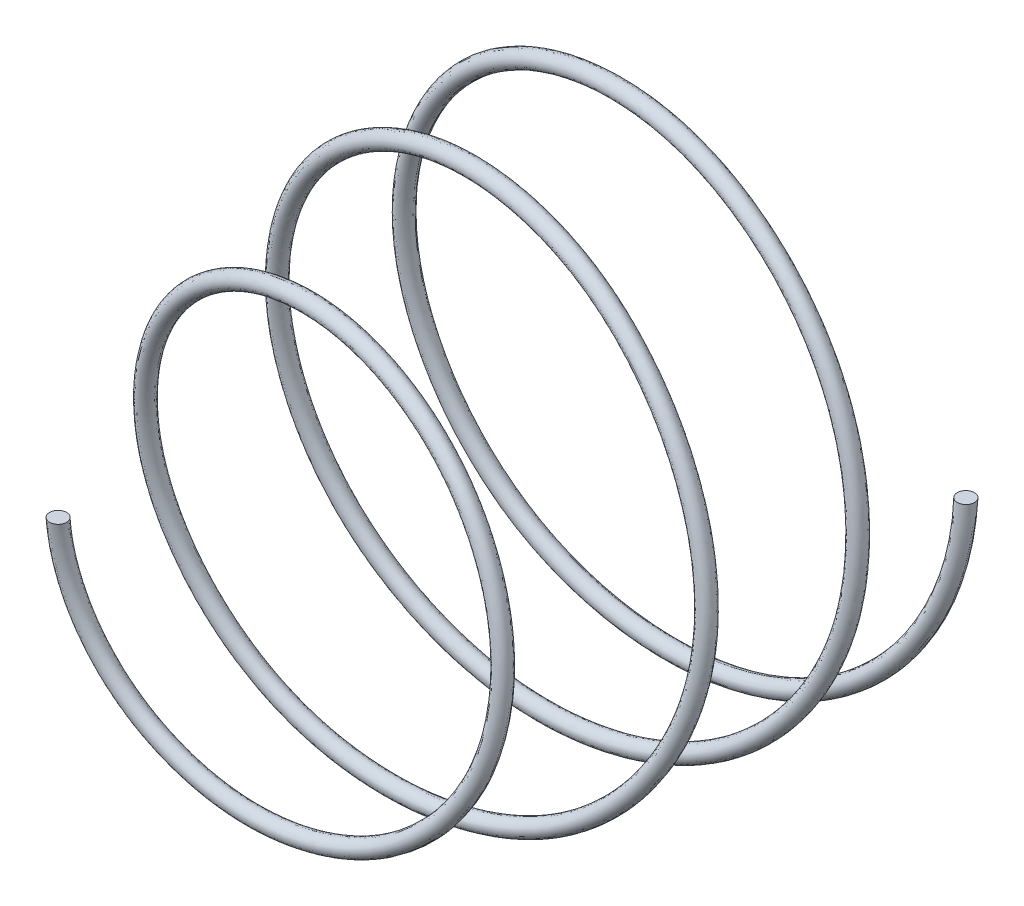
ISO-10303-21;
HEADER;
FILE_DESCRIPTION(('STEP AP214'),'2;1');
FILE_NAME('part.step','',(''),(''),'','','');
FILE_SCHEMA(('AUTOMOTIVE_DESIGN { 1 0 10303 214 1 1 1 1 }'));
ENDSEC;
DATA;
#1=APPLICATION_CONTEXT('core data for automotive mechanical design processes');
#2=APPLICATION_PROTOCOL_DEFINITION('international standard','automotive_design',2000,#1);
#3=PRODUCT_CONTEXT('',#1,'mechanical');
#4=PRODUCT('Part','Part','',(#3));
#5=PRODUCT_RELATED_PRODUCT_CATEGORY('part','',(#4));
#6=PRODUCT_DEFINITION_FORMATION('','',#4);
#7=PRODUCT_DEFINITION_CONTEXT('part definition',#1,'design');
#8=PRODUCT_DEFINITION('design','',#6,#7);
#9=PRODUCT_DEFINITION_SHAPE('','',#8);
#10=(LENGTH_UNIT() NAMED_UNIT(*) SI_UNIT(.MILLI.,.METRE.));
#11=(NAMED_UNIT(*) PLANE_ANGLE_UNIT() SI_UNIT($,.RADIAN.));
#12=(NAMED_UNIT(*) SI_UNIT($,.STERADIAN.) SOLID_ANGLE_UNIT());
#13=UNCERTAINTY_MEASURE_WITH_UNIT(LENGTH_MEASURE(1.E-05),#10,'distance_accuracy_value','');
#14=(GEOMETRIC_REPRESENTATION_CONTEXT(3) GLOBAL_UNCERTAINTY_ASSIGNED_CONTEXT((#13)) GLOBAL_UNIT_ASSIGNED_CONTEXT((#10,
#11,#12)) REPRESENTATION_CONTEXT('',''));
#15=CARTESIAN_POINT('',(0.,0.,0.));
#16=DIRECTION('',(0.,0.,1.));
#17=DIRECTION('',(1.,0.,0.));
#18=AXIS2_PLACEMENT_3D('',#15,#16,#17);
#19=CARTESIAN_POINT('',(3.,0.,0.));
#20=DIRECTION('',(0.,1.,0.));
#21=DIRECTION('',(0.,0.,1.));
#22=AXIS2_PLACEMENT_3D('',#19,#20,#21);
#23=PLANE('',#22);
#24=CARTESIAN_POINT('',(3.,0.,0.));
#25=DIRECTION('',(0.,1.,0.));
#26=DIRECTION('',(0.,0.,1.));
#27=AXIS2_PLACEMENT_3D('',#24,#25,#26);
#28=CIRCLE('',#27,0.0999999999999999);
#29=CARTESIAN_POINT('',(3.,0.,0.0999999999999999));
#30=VERTEX_POINT('',#29);
#31=EDGE_CURVE('E40',#30,#30,#28,.T.);
#32=ORIENTED_EDGE('',*,*,#31,.T.);
#33=EDGE_LOOP('',(#32));
#34=FACE_BOUND('',#33,.T.);
#35=ADVANCED_FACE('F36',(#34),#23,.T.);
#36=CARTESIAN_POINT('',(-2.1,1.02649551361988E-13,5.5));
#37=DIRECTION('',(0.,-1.,0.));
#38=DIRECTION('',(0.,0.,1.));
#39=AXIS2_PLACEMENT_3D('',#36,#37,#38);
#40=PLANE('',#39);
#41=CARTESIAN_POINT('',(-2.1,1.02649551361988E-13,5.5));
#42=DIRECTION('',(0.,-1.,0.));
#43=DIRECTION('',(0.,0.,1.));
#44=AXIS2_PLACEMENT_3D('',#41,#42,#43);
#45=CIRCLE('',#44,0.0999999999999999);
#46=CARTESIAN_POINT('',(-2.1,1.02649551361988E-13,5.6));
#47=VERTEX_POINT('',#46);
#48=EDGE_CURVE('E11',#47,#47,#45,.T.);
#49=ORIENTED_EDGE('',*,*,#48,.F.);
#50=EDGE_LOOP('',(#49));
#51=FACE_BOUND('',#50,.T.);
#52=ADVANCED_FACE('F77',(#51),#40,.F.);
#53=CARTESIAN_POINT('',(3.,0.,0.0999999999999999));
#54=CARTESIAN_POINT('',(2.99893943573948,-1.19945864909257,0.163633254270528));
#55=CARTESIAN_POINT('',(2.26141590246535,-2.24495827730856,0.225000000000012));
#56=CARTESIAN_POINT('',(0.309343025152512,-3.16948884114898,0.349999999999987));
#57=CARTESIAN_POINT('',(-0.858069160368535,-3.03935590705679,0.412499999999985));
#58=CARTESIAN_POINT('',(-2.51387042613628,-1.90838900097573,0.537500000000014));
#59=CARTESIAN_POINT('',(-2.99166666349542,-0.939532536844841,0.599999999999923));
#60=CARTESIAN_POINT('',(-2.98958333650458,0.93953253684488,0.725000000000075));
#61=CARTESIAN_POINT('',(-2.52383536970723,1.82979073821942,0.78750000000008));
#62=CARTESIAN_POINT('',(-1.11595664465713,2.90862029209121,0.912499999999918));
#63=CARTESIAN_POINT('',(-0.19218480510744,3.0959130192802,0.975000000000065));
#64=CARTESIAN_POINT('',(1.45328381503669,2.73809125305758,1.09999999999993));
#65=CARTESIAN_POINT('',(2.16476140340705,2.20292272191459,1.16249999999993));
#66=CARTESIAN_POINT('',(2.97646651153555,0.816875578736462,1.28750000000007));
#67=CARTESIAN_POINT('',(3.07674781408581,-0.0226899579926507,1.34999999999989));
#68=CARTESIAN_POINT('',(2.67930306497685,-1.50858152027044,1.47500000000011));
#69=CARTESIAN_POINT('',(2.18798393169004,-2.14837178627692,1.53750000000006));
#70=CARTESIAN_POINT('',(0.927966777340193,-2.92048914877486,1.66249999999993));
#71=CARTESIAN_POINT('',(0.166784962057753,-3.05241073871986,1.72500000000009));
#72=CARTESIAN_POINT('',(-1.23351426897467,-2.79483242778729,1.84999999999991));
#73=CARTESIAN_POINT('',(-1.86767735178331,-2.40918892074778,1.91249999999995));
#74=CARTESIAN_POINT('',(-2.73482571968324,-1.34192714345778,2.03750000000005));
#75=CARTESIAN_POINT('',(-2.96666666501538,-0.665484682180983,2.10000000000031));
#76=CARTESIAN_POINT('',(-2.96458333498463,0.665484682181117,2.22499999999969));
#77=CARTESIAN_POINT('',(-2.73263806383586,1.31594417076952,2.28750000000012));
#78=CARTESIAN_POINT('',(-1.93642374829777,2.33172450860302,2.41249999999988));
#79=CARTESIAN_POINT('',(-1.37563361890175,2.69529116691865,2.47499999999976));
#80=CARTESIAN_POINT('',(-0.164658784611858,3.01952299228008,2.60000000000024));
#81=CARTESIAN_POINT('',(0.482188493013176,2.98074741162969,2.66250000000024));
#82=CARTESIAN_POINT('',(2.19064349072477,2.32708601749865,2.84999999999952));
#83=CARTESIAN_POINT('',(2.9722916653456,1.15846277857306,2.9749999999998));
#84=CARTESIAN_POINT('',(2.931423612212,-0.965385648811021,3.20416666666683));
#85=CARTESIAN_POINT('',(2.36851985176624,-1.9001023240065,3.30833333333326));
#86=CARTESIAN_POINT('',(0.707269038493868,-2.88395233209354,3.51666666666674));
#87=CARTESIAN_POINT('',(-0.383655631251347,-2.9109885986085,3.62083333333363));
#88=CARTESIAN_POINT('',(-2.07667508609293,-1.98006422888091,3.82916666666637));
#89=CARTESIAN_POINT('',(-2.64212576016027,-1.03288439562604,3.93333333333374));
#90=CARTESIAN_POINT('',(-2.62462455435238,0.419628276364011,4.08958333333313));
#91=CARTESIAN_POINT('',(-2.48181132610865,0.902251102107171,4.14166666666663));
#92=CARTESIAN_POINT('',(-1.95828416959761,1.71928776876791,4.24583333333336));
#93=CARTESIAN_POINT('',(-1.57806748840913,2.05217328132252,4.29791666666654));
#94=CARTESIAN_POINT('',(-0.693770113991437,2.45795464461471,4.40208333333346));
#95=CARTESIAN_POINT('',(-0.191047487642285,2.52971768684621,4.4541666666663));
#96=CARTESIAN_POINT('',(0.773576208019876,2.37959228018941,4.5583333333337));
#97=CARTESIAN_POINT('',(1.23353528986769,2.15746751906624,4.61041666666629));
#98=CARTESIAN_POINT('',(1.94819923504846,1.48642760332087,4.71458333333371));
#99=CARTESIAN_POINT('',(2.20096048230321,1.03849260293051,4.7666666666664));
#100=CARTESIAN_POINT('',(2.39787352073171,0.0730164501274613,4.87083333333361));
#101=CARTESIAN_POINT('',(2.34085561055816,-0.442385695712135,4.92291666666672));
#102=CARTESIAN_POINT('',(1.92574091794239,-1.34276949725769,5.02708333333328));
#103=CARTESIAN_POINT('',(1.56797137832335,-1.7250201943906,5.07916666666652));
#104=CARTESIAN_POINT('',(0.68499714192297,-2.19202389641041,5.18333333333348));
#105=CARTESIAN_POINT('',(0.161940533937115,-2.27450193709028,5.235416666667));
#106=CARTESIAN_POINT('',(-0.828319883497029,-2.08738925968207,5.339583333333));
#107=CARTESIAN_POINT('',(-1.29197514442853,-1.81723610016765,5.3916666666662));
#108=CARTESIAN_POINT('',(-1.93847784203699,-1.03021233039892,5.4958333333338));
#109=CARTESIAN_POINT('',(-2.11776242487542,-0.516992193965065,5.54775756804655));
#110=CARTESIAN_POINT('',(-2.1,1.02649551361988E-13,5.6));
#111=CARTESIAN_POINT('',(3.05235987755983,0.,0.0999999999999999));
#112=CARTESIAN_POINT('',(3.05129931193206,-1.22039450177743,0.163633325912949));
#113=CARTESIAN_POINT('',(2.30091840642026,-2.28416460740022,0.225000000000012));
#114=CARTESIAN_POINT('',(0.314755515211678,-3.22488098052188,0.349999999999987));
#115=CARTESIAN_POINT('',(-0.873066297868183,-3.09249836484038,0.412499999999985));
#116=CARTESIAN_POINT('',(-2.55784759974763,-1.94178126305247,0.537500000000014));
#117=CARTESIAN_POINT('',(-3.04402654100071,-0.955981877231045,0.599999999999923));
#118=CARTESIAN_POINT('',(-3.04194321411896,0.955981877231085,0.725000000000075));
#119=CARTESIAN_POINT('',(-2.56805779175232,1.86184575593354,0.78750000000008));
#120=CARTESIAN_POINT('',(-1.13552637799794,2.95961217692946,0.912499999999918));
#121=CARTESIAN_POINT('',(-0.195560485642378,3.15021193157343,0.975000000000065));
#122=CARTESIAN_POINT('',(1.47878506281794,2.78614802642152,1.09999999999993));
#123=CARTESIAN_POINT('',(2.20276546647432,2.24160352379545,1.16249999999993));
#124=CARTESIAN_POINT('',(3.02875815132231,0.831231680596472,1.28750000000007));
#125=CARTESIAN_POINT('',(3.13082392926574,-0.0230841729868829,1.34999999999989));
#126=CARTESIAN_POINT('',(2.72642690589543,-1.53510934082298,1.47500000000011));
#127=CARTESIAN_POINT('',(2.22648275789266,-2.18616742299462,1.53750000000006));
#128=CARTESIAN_POINT('',(0.944308555375321,-2.9719052558982,1.66249999999993));
#129=CARTESIAN_POINT('',(0.169726750929349,-3.10617147784231,1.72500000000009));
#130=CARTESIAN_POINT('',(-1.25525019148232,-2.84409114145504,1.84999999999991));
#131=CARTESIAN_POINT('',(-1.9006033573851,-2.45166820643049,1.91249999999995));
#132=CARTESIAN_POINT('',(-2.78307411316886,-1.36560633451932,2.03750000000005));
#133=CARTESIAN_POINT('',(-3.01902654254697,-0.677234211024585,2.10000000000031));
#134=CARTESIAN_POINT('',(-3.01694321257269,0.677234211024722,2.22499999999969));
#135=CARTESIAN_POINT('',(-2.78092080281225,1.33919112357637,2.28750000000012));
#136=CARTESIAN_POINT('',(-1.97066303625897,2.37294725551964,2.41249999999988));
#137=CARTESIAN_POINT('',(-1.39996774823375,2.74296084488417,2.47499999999976));
#138=CARTESIAN_POINT('',(-0.167576869566425,3.0729648563303,2.60000000000024));
#139=CARTESIAN_POINT('',(0.490722252855258,3.03352393456592,2.66250000000024));
#140=CARTESIAN_POINT('',(2.22945638909099,2.36833688806319,2.84999999999952));
#141=CARTESIAN_POINT('',(3.02465154290308,1.1790245800108,2.9749999999998));
#142=CARTESIAN_POINT('',(2.98378348977379,-0.982520483342477,3.20416666666683));
#143=CARTESIAN_POINT('',(2.41177701112666,-1.93453899446505,3.30833333333326));
#144=CARTESIAN_POINT('',(0.720644118146694,-2.93760094199822,3.51666666666674));
#145=CARTESIAN_POINT('',(-0.390689360751117,-2.96606161430292,3.62083333333363));
#146=CARTESIAN_POINT('',(-2.11669984613355,-2.01854187151929,3.82916666666637));
#147=CARTESIAN_POINT('',(-2.69399750441175,-1.0534207236583,3.93333333333374));
#148=CARTESIAN_POINT('',(-2.6772048669131,0.427969916836899,4.08958333333313));
#149=CARTESIAN_POINT('',(-2.53190544925863,0.920392327773807,4.14166666666663));
#150=CARTESIAN_POINT('',(-1.998365215033,1.75438812537419,4.24583333333336));
#151=CARTESIAN_POINT('',(-1.61062602280596,2.09440039377581,4.29791666666654));
#152=CARTESIAN_POINT('',(-0.708321733534218,2.50925218403518,4.40208333333346));
#153=CARTESIAN_POINT('',(-0.195138502360652,2.58293031350303,4.4541666666663));
#154=CARTESIAN_POINT('',(0.79000649251283,2.43036989121744,4.5583333333337));
#155=CARTESIAN_POINT('',(1.25998610622379,2.20388253008547,4.61041666666629));
#156=CARTESIAN_POINT('',(1.99062499963396,1.51889379228058,4.71458333333371));
#157=CARTESIAN_POINT('',(2.24929475569156,1.06138613749353,4.7666666666664));
#158=CARTESIAN_POINT('',(2.45132815527124,0.0747246499579956,4.87083333333361));
#159=CARTESIAN_POINT('',(2.39348763595019,-0.452247480929685,4.92291666666672));
#160=CARTESIAN_POINT('',(1.96971363712527,-1.3733273908852,5.02708333333328));
#161=CARTESIAN_POINT('',(1.60410371620409,-1.76464093225814,5.07916666666652));
#162=CARTESIAN_POINT('',(0.70107621466077,-2.2431786823009,5.18333333333348));
#163=CARTESIAN_POINT('',(0.165847259807495,-2.32806616207426,5.235416666667));
#164=CARTESIAN_POINT('',(-0.848041472212217,-2.13734371526117,5.339583333333));
#165=CARTESIAN_POINT('',(-1.3230704551939,-1.86114305284091,5.3916666666662));
#166=CARTESIAN_POINT('',(-1.98594096277659,-1.05554987174361,5.4958333333338));
#167=CARTESIAN_POINT('',(-2.1701225385308,-0.529889374115339,5.54775687323474));
#168=CARTESIAN_POINT('',(-2.15235987755983,1.05208940857648E-13,5.6));
#169=CARTESIAN_POINT('',(3.1,0.,0.0523598775598298));
#170=CARTESIAN_POINT('',(3.09893943322176,-1.23944313595987,0.115993263069124));
#171=CARTESIAN_POINT('',(2.33686012769245,-2.31983685212341,0.177359877559857));
#172=CARTESIAN_POINT('',(0.319680119720795,-3.27528003462468,0.302359877559802));
#173=CARTESIAN_POINT('',(-0.886711583152111,-3.14085052518861,0.364859877559815));
#174=CARTESIAN_POINT('',(-2.59786064089775,-1.97216352382203,0.489859877559844));
#175=CARTESIAN_POINT('',(-3.09166666339108,-0.970948462841628,0.552359877559753));
#176=CARTESIAN_POINT('',(-3.08958333660892,0.970948462841668,0.677359877559905));
#177=CARTESIAN_POINT('',(-2.60829397447499,1.89101131246029,0.73985987755991));
#178=CARTESIAN_POINT('',(-1.15333208221119,3.00600761844652,0.864859877559748));
#179=CARTESIAN_POINT('',(-0.198631880028693,3.1996163028321,0.927359877559895));
#180=CARTESIAN_POINT('',(1.5019876107095,2.82987292941648,1.05235987755976));
#181=CARTESIAN_POINT('',(2.23734381734371,2.27679761177967,1.11485987755976));
#182=CARTESIAN_POINT('',(3.076336186989,0.844293713631169,1.2398598775599));
#183=CARTESIAN_POINT('',(3.18002558649495,-0.0234428531723363,1.30235987755972));
#184=CARTESIAN_POINT('',(2.76930297161284,-1.55924592551512,1.42735987755994));
#185=CARTESIAN_POINT('',(2.26151127361062,-2.22055613520816,1.48985987755989));
#186=CARTESIAN_POINT('',(0.959177274378613,-3.01868668001343,1.61485987755976));
#187=CARTESIAN_POINT('',(0.172403364943154,-3.15508618722718,1.67735987755992));
#188=CARTESIAN_POINT('',(-1.27502682309177,-2.88890964103415,1.80235987755974));
#189=CARTESIAN_POINT('',(-1.93056139035675,-2.4903183802928,1.8648598775597));
#190=CARTESIAN_POINT('',(-2.8269733635171,-1.38715106712811,1.98985987755996));
#191=CARTESIAN_POINT('',(-3.06666666496152,-0.687924629314504,2.05235987756014));
#192=CARTESIAN_POINT('',(-3.06458333503848,0.687924629314643,2.17735987755952));
#193=CARTESIAN_POINT('',(-2.82485130272521,1.36034258018189,2.23985987755995));
#194=CARTESIAN_POINT('',(-2.00181597142137,2.41045415587833,2.36485987755971));
#195=CARTESIAN_POINT('',(-1.42210838253005,2.78633354552441,2.42735987755959));
#196=CARTESIAN_POINT('',(-0.170231916350441,3.12158943425971,2.55235987756007));
#197=CARTESIAN_POINT('',(0.498486773757496,3.08154314568385,2.61485987756007));
#198=CARTESIAN_POINT('',(2.26477066629325,2.40586937698469,2.80235987755935));
#199=CARTESIAN_POINT('',(3.07229166534116,1.19773292662535,2.92735987755963));
#200=CARTESIAN_POINT('',(3.0314236122157,-0.998110772187935,3.15652654422666));
#201=CARTESIAN_POINT('',(2.45113494060202,-1.96587151993188,3.26069321089309));
#202=CARTESIAN_POINT('',(0.732813558985918,-2.98641362956949,3.46902654422657));
#203=CARTESIAN_POINT('',(-0.397089065070535,-3.0161703107537,3.57319321089346));
#204=CARTESIAN_POINT('',(-2.15311674697125,-2.05355111317369,3.7815265442262));
#205=CARTESIAN_POINT('',(-2.74119349421325,-1.07210589305755,3.88569321089357));
#206=CARTESIAN_POINT('',(-2.72504555419269,0.435559636141085,4.04194321089296));
#207=CARTESIAN_POINT('',(-2.57748405393882,0.936898290970262,4.09402654422646));
#208=CARTESIAN_POINT('',(-2.0348333276615,1.78632451186603,4.19819321089319));
#209=CARTESIAN_POINT('',(-1.64024970867809,2.13282112547582,4.25027654422637));
#210=CARTESIAN_POINT('',(-0.721561660154186,2.5559257282213,4.35444321089329));
#211=CARTESIAN_POINT('',(-0.198860750218561,2.63134631765412,4.40652654422613));
#212=CARTESIAN_POINT('',(0.80495573994139,2.47657037371164,4.51069321089353));
#213=CARTESIAN_POINT('',(1.28405262793037,2.24611366031471,4.56277654422612));
#214=CARTESIAN_POINT('',(2.02922647682728,1.54843345679643,4.66694321089354));
#215=CARTESIAN_POINT('',(2.29327214466933,1.08221603321712,4.71902654422623));
#216=CARTESIAN_POINT('',(2.49996435254936,0.0762788714892765,4.82319321089344));
#217=CARTESIAN_POINT('',(2.44137537463095,-0.461220318093207,4.87527654422655));
#218=CARTESIAN_POINT('',(2.00972262537232,-1.40113077511315,4.97944321089311));
#219=CARTESIAN_POINT('',(1.63697906047356,-1.80069022975731,5.03152654422635));
#220=CARTESIAN_POINT('',(0.715705908801648,-2.28972234085785,5.13569321089331));
#221=CARTESIAN_POINT('',(0.169401830740036,-2.37680207123907,5.18777654422683));
#222=CARTESIAN_POINT('',(-0.865985343452807,-2.18279524210086,5.29194321089283));
#223=CARTESIAN_POINT('',(-1.35136281341212,-1.90109220281624,5.34402654422603));
#224=CARTESIAN_POINT('',(-2.02912572540013,-1.07860346980857,5.44819321089363));
#225=CARTESIAN_POINT('',(-2.21776286070228,-0.541623987612379,5.50011616297629));
#226=CARTESIAN_POINT('',(-2.2,1.07537625236369E-13,5.55235987755983));
#227=CARTESIAN_POINT('',(3.1,0.,-0.0523598775598298));
#228=CARTESIAN_POINT('',(3.09893943322176,-1.23944313595987,0.0112735079494647));
#229=CARTESIAN_POINT('',(2.33686012769245,-2.31983685212341,0.0726401224401974));
#230=CARTESIAN_POINT('',(0.319680119720795,-3.27528003462468,0.197640122440142));
#231=CARTESIAN_POINT('',(-0.886711583152111,-3.14085052518861,0.260140122440155));
#232=CARTESIAN_POINT('',(-2.59786064089775,-1.97216352382203,0.385140122440184));
#233=CARTESIAN_POINT('',(-3.09166666339108,-0.970948462841628,0.447640122440093));
#234=CARTESIAN_POINT('',(-3.08958333660892,0.970948462841668,0.572640122440245));
#235=CARTESIAN_POINT('',(-2.60829397447499,1.89101131246029,0.635140122440251));
#236=CARTESIAN_POINT('',(-1.15333208221119,3.00600761844652,0.760140122440088));
#237=CARTESIAN_POINT('',(-0.198631880028693,3.1996163028321,0.822640122440236));
#238=CARTESIAN_POINT('',(1.5019876107095,2.82987292941648,0.947640122440104));
#239=CARTESIAN_POINT('',(2.23734381734371,2.27679761177967,1.0101401224401));
#240=CARTESIAN_POINT('',(3.076336186989,0.844293713631169,1.13514012244024));
#241=CARTESIAN_POINT('',(3.18002558649495,-0.0234428531723363,1.19764012244006));
#242=CARTESIAN_POINT('',(2.76930297161284,-1.55924592551512,1.32264012244028));
#243=CARTESIAN_POINT('',(2.26151127361062,-2.22055613520816,1.38514012244024));
#244=CARTESIAN_POINT('',(0.959177274378613,-3.01868668001343,1.5101401224401));
#245=CARTESIAN_POINT('',(0.172403364943154,-3.15508618722718,1.57264012244026));
#246=CARTESIAN_POINT('',(-1.27502682309177,-2.88890964103415,1.69764012244008));
#247=CARTESIAN_POINT('',(-1.93056139035675,-2.4903183802928,1.76014012244004));
#248=CARTESIAN_POINT('',(-2.8269733635171,-1.38715106712811,1.8851401224403));
#249=CARTESIAN_POINT('',(-3.06666666496152,-0.687924629314504,1.94764012244048));
#250=CARTESIAN_POINT('',(-3.06458333503848,0.687924629314643,2.07264012243986));
#251=CARTESIAN_POINT('',(-2.82485130272521,1.36034258018189,2.13514012244029));
#252=CARTESIAN_POINT('',(-2.00181597142137,2.41045415587833,2.26014012244005));
#253=CARTESIAN_POINT('',(-1.42210838253005,2.78633354552441,2.32264012243993));
#254=CARTESIAN_POINT('',(-0.170231916350441,3.12158943425971,2.44764012244041));
#255=CARTESIAN_POINT('',(0.498486773757496,3.08154314568385,2.51014012244041));
#256=CARTESIAN_POINT('',(2.26477066629325,2.40586937698469,2.69764012243969));
#257=CARTESIAN_POINT('',(3.07229166534116,1.19773292662535,2.82264012243997));
#258=CARTESIAN_POINT('',(3.0314236122157,-0.998110772187935,3.051806789107));
#259=CARTESIAN_POINT('',(2.45113494060202,-1.96587151993188,3.15597345577343));
#260=CARTESIAN_POINT('',(0.732813558985918,-2.98641362956949,3.36430678910691));
#261=CARTESIAN_POINT('',(-0.397089065070535,-3.0161703107537,3.4684734557738));
#262=CARTESIAN_POINT('',(-2.15311674697125,-2.05355111317369,3.67680678910654));
#263=CARTESIAN_POINT('',(-2.74119349421325,-1.07210589305755,3.78097345577391));
#264=CARTESIAN_POINT('',(-2.72504555419269,0.435559636141085,3.9372234557733));
#265=CARTESIAN_POINT('',(-2.57748405393882,0.936898290970262,3.9893067891068));
#266=CARTESIAN_POINT('',(-2.0348333276615,1.78632451186603,4.09347345577353));
#267=CARTESIAN_POINT('',(-1.64024970867809,2.13282112547582,4.14555678910671));
#268=CARTESIAN_POINT('',(-0.721561660154186,2.5559257282213,4.24972345577363));
#269=CARTESIAN_POINT('',(-0.198860750218561,2.63134631765412,4.30180678910647));
#270=CARTESIAN_POINT('',(0.80495573994139,2.47657037371164,4.40597345577387));
#271=CARTESIAN_POINT('',(1.28405262793037,2.24611366031471,4.45805678910646));
#272=CARTESIAN_POINT('',(2.02922647682728,1.54843345679643,4.56222345577388));
#273=CARTESIAN_POINT('',(2.29327214466933,1.08221603321712,4.61430678910657));
#274=CARTESIAN_POINT('',(2.49996435254936,0.0762788714892765,4.71847345577378));
#275=CARTESIAN_POINT('',(2.44137537463095,-0.461220318093207,4.77055678910689));
#276=CARTESIAN_POINT('',(2.00972262537232,-1.40113077511315,4.87472345577345));
#277=CARTESIAN_POINT('',(1.63697906047356,-1.80069022975731,4.92680678910669));
#278=CARTESIAN_POINT('',(0.715705908801648,-2.28972234085785,5.03097345577365));
#279=CARTESIAN_POINT('',(0.169401830740036,-2.37680207123907,5.08305678910717));
#280=CARTESIAN_POINT('',(-0.865985343452807,-2.18279524210086,5.18722345577317));
#281=CARTESIAN_POINT('',(-1.35136281341212,-1.90109220281624,5.23930678910637));
#282=CARTESIAN_POINT('',(-2.02912572540013,-1.07860346980857,5.34347345577397));
#283=CARTESIAN_POINT('',(-2.21776286070228,-0.541623987612379,5.39539640785663));
#284=CARTESIAN_POINT('',(-2.2,1.07537625236369E-13,5.44764012244017));
#285=CARTESIAN_POINT('',(3.05235987755983,0.,-0.0999999999999999));
#286=CARTESIAN_POINT('',(3.05129931193206,-1.22039450177743,-0.0363666740870503));
#287=CARTESIAN_POINT('',(2.30091840642026,-2.28416460740022,0.0250000000000274));
#288=CARTESIAN_POINT('',(0.314755515211678,-3.22488098052188,0.149999999999972));
#289=CARTESIAN_POINT('',(-0.873066297868183,-3.09249836484038,0.212499999999985));
#290=CARTESIAN_POINT('',(-2.55784759974763,-1.94178126305247,0.337500000000014));
#291=CARTESIAN_POINT('',(-3.04402654100071,-0.955981877231045,0.399999999999923));
#292=CARTESIAN_POINT('',(-3.04194321411896,0.955981877231085,0.525000000000075));
#293=CARTESIAN_POINT('',(-2.56805779175232,1.86184575593354,0.587500000000081));
#294=CARTESIAN_POINT('',(-1.13552637799794,2.95961217692946,0.712499999999918));
#295=CARTESIAN_POINT('',(-0.195560485642378,3.15021193157343,0.775000000000066));
#296=CARTESIAN_POINT('',(1.47878506281794,2.78614802642152,0.899999999999934));
#297=CARTESIAN_POINT('',(2.20276546647432,2.24160352379545,0.962499999999933));
#298=CARTESIAN_POINT('',(3.02875815132231,0.831231680596472,1.08750000000007));
#299=CARTESIAN_POINT('',(3.13082392926574,-0.0230841729868829,1.14999999999989));
#300=CARTESIAN_POINT('',(2.72642690589543,-1.53510934082298,1.27500000000011));
#301=CARTESIAN_POINT('',(2.22648275789266,-2.18616742299462,1.33750000000006));
#302=CARTESIAN_POINT('',(0.944308555375321,-2.9719052558982,1.46249999999993));
#303=CARTESIAN_POINT('',(0.169726750929349,-3.10617147784231,1.52500000000009));
#304=CARTESIAN_POINT('',(-1.25525019148232,-2.84409114145504,1.64999999999991));
#305=CARTESIAN_POINT('',(-1.9006033573851,-2.45166820643049,1.71249999999987));
#306=CARTESIAN_POINT('',(-2.78307411316886,-1.36560633451932,1.83750000000013));
#307=CARTESIAN_POINT('',(-3.01902654254697,-0.677234211024585,1.90000000000031));
#308=CARTESIAN_POINT('',(-3.01694321257269,0.677234211024722,2.02499999999969));
#309=CARTESIAN_POINT('',(-2.78092080281225,1.33919112357637,2.08750000000012));
#310=CARTESIAN_POINT('',(-1.97066303625897,2.37294725551964,2.21249999999988));
#311=CARTESIAN_POINT('',(-1.39996774823375,2.74296084488417,2.27499999999976));
#312=CARTESIAN_POINT('',(-0.167576869566425,3.0729648563303,2.40000000000024));
#313=CARTESIAN_POINT('',(0.490722252855258,3.03352393456592,2.46250000000024));
#314=CARTESIAN_POINT('',(2.22945638909099,2.36833688806319,2.64999999999952));
#315=CARTESIAN_POINT('',(3.02465154290308,1.1790245800108,2.7749999999998));
#316=CARTESIAN_POINT('',(2.98378348977379,-0.982520483342477,3.00416666666683));
#317=CARTESIAN_POINT('',(2.41177701112666,-1.93453899446505,3.10833333333326));
#318=CARTESIAN_POINT('',(0.720644118146694,-2.93760094199822,3.31666666666674));
#319=CARTESIAN_POINT('',(-0.390689360751117,-2.96606161430292,3.42083333333363));
#320=CARTESIAN_POINT('',(-2.11669984613355,-2.01854187151929,3.62916666666637));
#321=CARTESIAN_POINT('',(-2.69399750441175,-1.0534207236583,3.73333333333374));
#322=CARTESIAN_POINT('',(-2.6772048669131,0.427969916836899,3.88958333333313));
#323=CARTESIAN_POINT('',(-2.53190544925863,0.920392327773807,3.94166666666663));
#324=CARTESIAN_POINT('',(-1.998365215033,1.75438812537419,4.04583333333336));
#325=CARTESIAN_POINT('',(-1.61062602280596,2.09440039377581,4.09791666666654));
#326=CARTESIAN_POINT('',(-0.708321733534218,2.50925218403518,4.20208333333346));
#327=CARTESIAN_POINT('',(-0.195138502360652,2.58293031350303,4.2541666666663));
#328=CARTESIAN_POINT('',(0.79000649251283,2.43036989121744,4.3583333333337));
#329=CARTESIAN_POINT('',(1.25998610622379,2.20388253008547,4.41041666666629));
#330=CARTESIAN_POINT('',(1.99062499963396,1.51889379228058,4.51458333333371));
#331=CARTESIAN_POINT('',(2.24929475569156,1.06138613749353,4.5666666666664));
#332=CARTESIAN_POINT('',(2.45132815527124,0.0747246499579956,4.67083333333361));
#333=CARTESIAN_POINT('',(2.39348763595019,-0.452247480929685,4.72291666666672));
#334=CARTESIAN_POINT('',(1.96971363712527,-1.3733273908852,4.82708333333328));
#335=CARTESIAN_POINT('',(1.60410371620409,-1.76464093225814,4.87916666666652));
#336=CARTESIAN_POINT('',(0.70107621466077,-2.2431786823009,4.98333333333348));
#337=CARTESIAN_POINT('',(0.165847259807495,-2.32806616207426,5.035416666667));
#338=CARTESIAN_POINT('',(-0.848041472212217,-2.13734371526117,5.139583333333));
#339=CARTESIAN_POINT('',(-1.3230704551939,-1.86114305284091,5.1916666666662));
#340=CARTESIAN_POINT('',(-1.98594096277659,-1.05554987174361,5.2958333333338));
#341=CARTESIAN_POINT('',(-2.1701225385308,-0.529889374115339,5.34775687323474));
#342=CARTESIAN_POINT('',(-2.15235987755983,1.05208940857648E-13,5.4));
#343=CARTESIAN_POINT('',(2.94764012244017,0.,-0.0999999999999999));
#344=CARTESIAN_POINT('',(2.9465795595469,-1.17852279640771,-0.036366817371894));
#345=CARTESIAN_POINT('',(2.22191339851045,-2.20575194721689,0.0250000000000274));
#346=CARTESIAN_POINT('',(0.303930535093346,-3.11409670177608,0.149999999999972));
#347=CARTESIAN_POINT('',(-0.843072022868886,-2.9862134492732,0.212499999999985));
#348=CARTESIAN_POINT('',(-2.46989325252494,-1.874996738899,0.337500000000014));
#349=CARTESIAN_POINT('',(-2.93930678599014,-0.923083196458637,0.399999999999923));
#350=CARTESIAN_POINT('',(-2.9372234588902,0.923083196458675,0.525000000000075));
#351=CARTESIAN_POINT('',(-2.47961294766215,1.7977357205053,0.587500000000081));
#352=CARTESIAN_POINT('',(-1.09638691131631,2.85762840725296,0.712499999999918));
#353=CARTESIAN_POINT('',(-0.188809124572503,3.04161410698696,0.775000000000066));
#354=CARTESIAN_POINT('',(1.42778256725544,2.69003447969365,0.899999999999934));
#355=CARTESIAN_POINT('',(2.12675734033979,2.16424192003373,0.962499999999933));
#356=CARTESIAN_POINT('',(2.92417487174879,0.802519476876453,1.08750000000007));
#357=CARTESIAN_POINT('',(3.02267169890588,-0.0222957429984185,1.14999999999989));
#358=CARTESIAN_POINT('',(2.63217922405827,-1.48205369971791,1.27500000000011));
#359=CARTESIAN_POINT('',(2.14948510548743,-2.11057614955923,1.33750000000006));
#360=CARTESIAN_POINT('',(0.911624999305064,-2.86907304165151,1.46249999999993));
#361=CARTESIAN_POINT('',(0.163843173186156,-2.99864999959741,1.52500000000009));
#362=CARTESIAN_POINT('',(-1.21177834646702,-2.74557371411955,1.64999999999991));
#363=CARTESIAN_POINT('',(-1.83475134618153,-2.36670963506506,1.71249999999987));
#364=CARTESIAN_POINT('',(-2.68657732619762,-1.31824795239624,1.83750000000013));
#365=CARTESIAN_POINT('',(-2.91430678748379,-0.65373515333738,1.90000000000031));
#366=CARTESIAN_POINT('',(-2.91222345739656,0.653735153337513,2.02499999999969));
#367=CARTESIAN_POINT('',(-2.68435532485947,1.29269721796268,2.08750000000012));
#368=CARTESIAN_POINT('',(-1.90218446033658,2.2905017616864,2.21249999999988));
#369=CARTESIAN_POINT('',(-1.35129948956975,2.64762148895314,2.27499999999976));
#370=CARTESIAN_POINT('',(-0.16174069965729,2.96608112822986,2.40000000000024));
#371=CARTESIAN_POINT('',(0.473654733171094,2.92797088869347,2.46250000000024));
#372=CARTESIAN_POINT('',(2.15183059235855,2.28583514693411,2.64999999999952));
#373=CARTESIAN_POINT('',(2.91993178778812,1.13790097713531,2.7749999999998));
#374=CARTESIAN_POINT('',(2.87906373465021,-0.948250814279566,3.00416666666683));
#375=CARTESIAN_POINT('',(2.32526269240583,-1.86566565354795,3.10833333333326));
#376=CARTESIAN_POINT('',(0.693893958841042,-2.83030372218886,3.31666666666674));
#377=CARTESIAN_POINT('',(-0.376621901751576,-2.85591558291409,3.42083333333363));
#378=CARTESIAN_POINT('',(-2.0366503260523,-1.94158658624254,3.62916666666637));
#379=CARTESIAN_POINT('',(-2.59025401590879,-1.01234806759378,3.73333333333374));
#380=CARTESIAN_POINT('',(-2.57204424179166,0.411286635891123,3.88958333333313));
#381=CARTESIAN_POINT('',(-2.43171720295868,0.884109876440535,3.94166666666663));
#382=CARTESIAN_POINT('',(-1.91820312416222,1.68418741216163,4.04583333333336));
#383=CARTESIAN_POINT('',(-1.54550895401231,2.00994616886923,4.09791666666654));
#384=CARTESIAN_POINT('',(-0.679218494448655,2.40665710519424,4.20208333333346));
#385=CARTESIAN_POINT('',(-0.186956472923917,2.47650506018939,4.2541666666663));
#386=CARTESIAN_POINT('',(0.757145923526923,2.32881466916137,4.3583333333337));
#387=CARTESIAN_POINT('',(1.20708447351158,2.11105250804702,4.41041666666629));
#388=CARTESIAN_POINT('',(1.90577347046297,1.45396141436116,4.51458333333371));
#389=CARTESIAN_POINT('',(2.15262620891485,1.01559906836749,4.5666666666664));
#390=CARTESIAN_POINT('',(2.34441888619219,0.071308250296927,4.67083333333361));
#391=CARTESIAN_POINT('',(2.28822358516612,-0.432523910494585,4.72291666666672));
#392=CARTESIAN_POINT('',(1.88176819875951,-1.31221160363018,4.82708333333328));
#393=CARTESIAN_POINT('',(1.53183904044262,-1.68539945652305,4.87916666666652));
#394=CARTESIAN_POINT('',(0.668918069185169,-2.14086911051993,4.98333333333348));
#395=CARTESIAN_POINT('',(0.158033808066734,-2.2209377121063,5.035416666667));
#396=CARTESIAN_POINT('',(-0.808598294781841,-2.03743480410297,5.139583333333));
#397=CARTESIAN_POINT('',(-1.26087983366316,-1.77332914749439,5.1916666666662));
#398=CARTESIAN_POINT('',(-1.8910147212974,-1.00487478905423,5.2958333333338));
#399=CARTESIAN_POINT('',(-2.06540231122005,-0.504095013814792,5.34775826285837));
#400=CARTESIAN_POINT('',(-2.04764012244017,1.00090161866329E-13,5.4));
#401=CARTESIAN_POINT('',(2.9,0.,-0.0523598775598298));
#402=CARTESIAN_POINT('',(2.8989394384528,-1.15947406616398,0.0112732337360669));
#403=CARTESIAN_POINT('',(2.18597167723813,-2.1700797024937,0.0726401224401974));
#404=CARTESIAN_POINT('',(0.299005930584349,-3.06369764767328,0.197640122440142));
#405=CARTESIAN_POINT('',(-0.829426737585071,-2.93786128892497,0.260140122440155));
#406=CARTESIAN_POINT('',(-2.4298802113747,-1.84461447812943,0.385140122440184));
#407=CARTESIAN_POINT('',(-2.89166666359956,-0.908116610848056,0.447640122440093));
#408=CARTESIAN_POINT('',(-2.88958333640045,0.908116610848093,0.572640122440245));
#409=CARTESIAN_POINT('',(-2.43937676493958,1.76857016397855,0.635140122440251));
#410=CARTESIAN_POINT('',(-1.07858120710296,2.81123296573591,0.760140122440088));
#411=CARTESIAN_POINT('',(-0.185737730186236,2.99220973572849,0.822640122440236));
#412=CARTESIAN_POINT('',(1.40458001936393,2.6463095766985,0.947640122440104));
#413=CARTESIAN_POINT('',(2.09217898947022,2.12904783204951,1.0101401224401));
#414=CARTESIAN_POINT('',(2.87659683608228,0.789457443841756,1.13514012244024));
#415=CARTESIAN_POINT('',(2.97347004167667,-0.0219370628129654,1.19764012244006));
#416=CARTESIAN_POINT('',(2.58930315834086,-1.45791711502576,1.32264012244028));
#417=CARTESIAN_POINT('',(2.11445658976938,-2.07618743734602,1.38514012244024));
#418=CARTESIAN_POINT('',(0.896756280301856,-2.82229161753595,1.5101401224401));
#419=CARTESIAN_POINT('',(0.161166559172391,-2.94973529021254,1.57264012244026));
#420=CARTESIAN_POINT('',(-1.19200171485761,-2.70075521454043,1.69764012244008));
#421=CARTESIAN_POINT('',(-1.80479331320988,-2.32805946120268,1.76014012244004));
#422=CARTESIAN_POINT('',(-2.64267807584938,-1.29670321978754,1.8851401224403));
#423=CARTESIAN_POINT('',(-2.86666666506923,-0.643044735047462,1.94764012244048));
#424=CARTESIAN_POINT('',(-2.86458333493077,0.643044735047592,2.07264012243986));
#425=CARTESIAN_POINT('',(-2.64042482494651,1.27154576135709,2.13514012244029));
#426=CARTESIAN_POINT('',(-1.87103152517418,2.25299486132777,2.26014012244005));
#427=CARTESIAN_POINT('',(-1.32915885527342,2.60424878831275,2.32264012243993));
#428=CARTESIAN_POINT('',(-0.15908565287331,2.91745655030059,2.44764012244041));
#429=CARTESIAN_POINT('',(0.465890212268924,2.87995167757554,2.51014012244041));
#430=CARTESIAN_POINT('',(2.11651631515615,2.24830265801261,2.69764012243969));
#431=CARTESIAN_POINT('',(2.87229166535004,1.11919263052077,2.82264012243997));
#432=CARTESIAN_POINT('',(2.8314236122083,-0.932660525434108,3.051806789107));
#433=CARTESIAN_POINT('',(2.28590476293035,-1.83433312808113,3.15597345577343));
#434=CARTESIAN_POINT('',(0.681724518001927,-2.78149103461759,3.36430678910691));
#435=CARTESIAN_POINT('',(-0.370222197432049,-2.80580688646353,3.4684734557738));
#436=CARTESIAN_POINT('',(-2.00023342521472,-1.90657734458792,3.67680678910654));
#437=CARTESIAN_POINT('',(-2.54305802610685,-0.993662898194536,3.78097345577391));
#438=CARTESIAN_POINT('',(-2.5242035545123,0.403696916586937,3.9372234557733));
#439=CARTESIAN_POINT('',(-2.38613859827848,0.867603913244079,3.9893067891068));
#440=CARTESIAN_POINT('',(-1.88173501153372,1.65225102566979,4.09347345577353));
#441=CARTESIAN_POINT('',(-1.51588526814012,1.97152543716922,4.14555678910671));
#442=CARTESIAN_POINT('',(-0.665978567828742,2.35998356100812,4.24972345577363));
#443=CARTESIAN_POINT('',(-0.183234225066009,2.4280890560383,4.30180678910647));
#444=CARTESIAN_POINT('',(0.742196676098363,2.28261418666718,4.40597345577387));
#445=CARTESIAN_POINT('',(1.18301795180512,2.06882137781778,4.45805678910646));
#446=CARTESIAN_POINT('',(1.86717199326954,1.42442174984532,4.56222345577388));
#447=CARTESIAN_POINT('',(2.10864881993708,0.994769172643904,4.61430678910657));
#448=CARTESIAN_POINT('',(2.29578268891406,0.0697540287656462,4.71847345577378));
#449=CARTESIAN_POINT('',(2.24033584648525,-0.423551073331063,4.77055678910689));
#450=CARTESIAN_POINT('',(1.84175921051257,-1.28440821940223,4.87472345577345));
#451=CARTESIAN_POINT('',(1.49896369617315,-1.64935015902389,4.92680678910669));
#452=CARTESIAN_POINT('',(0.654288375044292,-2.09432545196297,5.03097345577365));
#453=CARTESIAN_POINT('',(0.154479237134208,-2.17220180294125,5.08305678910717));
#454=CARTESIAN_POINT('',(-0.790654423541265,-1.99198327726351,5.18722345577317));
#455=CARTESIAN_POINT('',(-1.23258747544494,-1.73337999751912,5.23930678910637));
#456=CARTESIAN_POINT('',(-1.84782995867385,-0.981821190989203,5.34347345577397));
#457=CARTESIAN_POINT('',(-2.01776195737175,-0.492360388187149,5.39539906628666));
#458=CARTESIAN_POINT('',(-2.,0.,5.44764012244017));
#459=CARTESIAN_POINT('',(2.9,0.,0.0523598775598298));
#460=CARTESIAN_POINT('',(2.8989394384528,-1.15947406616398,0.115992988855727));
#461=CARTESIAN_POINT('',(2.18597167723813,-2.1700797024937,0.177359877559857));
#462=CARTESIAN_POINT('',(0.299005930584349,-3.06369764767328,0.302359877559802));
#463=CARTESIAN_POINT('',(-0.829426737585071,-2.93786128892497,0.364859877559815));
#464=CARTESIAN_POINT('',(-2.4298802113747,-1.84461447812943,0.489859877559844));
#465=CARTESIAN_POINT('',(-2.89166666359956,-0.908116610848056,0.552359877559753));
#466=CARTESIAN_POINT('',(-2.88958333640045,0.908116610848093,0.677359877559905));
#467=CARTESIAN_POINT('',(-2.43937676493958,1.76857016397855,0.73985987755991));
#468=CARTESIAN_POINT('',(-1.07858120710296,2.81123296573591,0.864859877559748));
#469=CARTESIAN_POINT('',(-0.185737730186236,2.99220973572849,0.927359877559895));
#470=CARTESIAN_POINT('',(1.40458001936393,2.6463095766985,1.05235987755976));
#471=CARTESIAN_POINT('',(2.09217898947022,2.12904783204951,1.11485987755976));
#472=CARTESIAN_POINT('',(2.87659683608228,0.789457443841756,1.2398598775599));
#473=CARTESIAN_POINT('',(2.97347004167667,-0.0219370628129654,1.30235987755972));
#474=CARTESIAN_POINT('',(2.58930315834086,-1.45791711502576,1.42735987755994));
#475=CARTESIAN_POINT('',(2.11445658976938,-2.07618743734602,1.48985987755989));
#476=CARTESIAN_POINT('',(0.896756280301856,-2.82229161753595,1.61485987755976));
#477=CARTESIAN_POINT('',(0.161166559172391,-2.94973529021254,1.67735987755992));
#478=CARTESIAN_POINT('',(-1.19200171485761,-2.70075521454043,1.80235987755974));
#479=CARTESIAN_POINT('',(-1.80479331320988,-2.32805946120268,1.8648598775597));
#480=CARTESIAN_POINT('',(-2.64267807584938,-1.29670321978754,1.98985987755996));
#481=CARTESIAN_POINT('',(-2.86666666506923,-0.643044735047462,2.05235987756014));
#482=CARTESIAN_POINT('',(-2.86458333493077,0.643044735047592,2.17735987755952));
#483=CARTESIAN_POINT('',(-2.64042482494651,1.27154576135709,2.23985987755995));
#484=CARTESIAN_POINT('',(-1.87103152517418,2.25299486132777,2.36485987755971));
#485=CARTESIAN_POINT('',(-1.32915885527342,2.60424878831275,2.42735987755973));
#486=CARTESIAN_POINT('',(-0.15908565287331,2.91745655030059,2.55235987755993));
#487=CARTESIAN_POINT('',(0.465890212268924,2.87995167757554,2.61485987756007));
#488=CARTESIAN_POINT('',(2.11651631515615,2.24830265801261,2.80235987755935));
#489=CARTESIAN_POINT('',(2.87229166535004,1.11919263052077,2.92735987755963));
#490=CARTESIAN_POINT('',(2.8314236122083,-0.932660525434108,3.15652654422666));
#491=CARTESIAN_POINT('',(2.28590476293035,-1.83433312808113,3.26069321089309));
#492=CARTESIAN_POINT('',(0.681724518001927,-2.78149103461759,3.46902654422657));
#493=CARTESIAN_POINT('',(-0.370222197432049,-2.80580688646353,3.57319321089346));
#494=CARTESIAN_POINT('',(-2.00023342521472,-1.90657734458792,3.7815265442262));
#495=CARTESIAN_POINT('',(-2.54305802610685,-0.993662898194536,3.88569321089357));
#496=CARTESIAN_POINT('',(-2.5242035545123,0.403696916586937,4.04194321089296));
#497=CARTESIAN_POINT('',(-2.38613859827848,0.867603913244079,4.09402654422646));
#498=CARTESIAN_POINT('',(-1.88173501153372,1.65225102566979,4.19819321089319));
#499=CARTESIAN_POINT('',(-1.51588526814012,1.97152543716922,4.25027654422637));
#500=CARTESIAN_POINT('',(-0.665978567828742,2.35998356100812,4.35444321089329));
#501=CARTESIAN_POINT('',(-0.183234225066009,2.4280890560383,4.40652654422613));
#502=CARTESIAN_POINT('',(0.742196676098363,2.28261418666718,4.51069321089353));
#503=CARTESIAN_POINT('',(1.18301795180512,2.06882137781778,4.56277654422612));
#504=CARTESIAN_POINT('',(1.86717199326954,1.42442174984532,4.66694321089354));
#505=CARTESIAN_POINT('',(2.10864881993708,0.994769172643904,4.71902654422623));
#506=CARTESIAN_POINT('',(2.29578268891406,0.0697540287656462,4.82319321089344));
#507=CARTESIAN_POINT('',(2.24033584648525,-0.423551073331063,4.87527654422655));
#508=CARTESIAN_POINT('',(1.84175921051257,-1.28440821940223,4.97944321089311));
#509=CARTESIAN_POINT('',(1.49896369617315,-1.64935015902389,5.03152654422635));
#510=CARTESIAN_POINT('',(0.654288375044292,-2.09432545196297,5.13569321089331));
#511=CARTESIAN_POINT('',(0.154479237134208,-2.17220180294125,5.18777654422683));
#512=CARTESIAN_POINT('',(-0.790654423541265,-1.99198327726351,5.29194321089283));
#513=CARTESIAN_POINT('',(-1.23258747544494,-1.73337999751912,5.34402654422603));
#514=CARTESIAN_POINT('',(-1.84782995867385,-0.981821190989203,5.44819321089363));
#515=CARTESIAN_POINT('',(-2.01776195737175,-0.492360388187149,5.50011882140632));
#516=CARTESIAN_POINT('',(-2.,0.,5.55235987755983));
#517=CARTESIAN_POINT('',(2.94764012244017,0.,0.0999999999999999));
#518=CARTESIAN_POINT('',(2.9465795595469,-1.17852279640771,0.163633182628106));
#519=CARTESIAN_POINT('',(2.22191339851045,-2.20575194721689,0.225000000000012));
#520=CARTESIAN_POINT('',(0.303930535093346,-3.11409670177608,0.349999999999987));
#521=CARTESIAN_POINT('',(-0.843072022868886,-2.9862134492732,0.412499999999985));
#522=CARTESIAN_POINT('',(-2.46989325252494,-1.874996738899,0.537500000000014));
#523=CARTESIAN_POINT('',(-2.93930678599014,-0.923083196458637,0.599999999999923));
#524=CARTESIAN_POINT('',(-2.9372234588902,0.923083196458675,0.725000000000075));
#525=CARTESIAN_POINT('',(-2.47961294766215,1.7977357205053,0.78750000000008));
#526=CARTESIAN_POINT('',(-1.09638691131631,2.85762840725296,0.912499999999918));
#527=CARTESIAN_POINT('',(-0.188809124572503,3.04161410698696,0.975000000000065));
#528=CARTESIAN_POINT('',(1.42778256725544,2.69003447969365,1.09999999999993));
#529=CARTESIAN_POINT('',(2.12675734033979,2.16424192003373,1.16249999999993));
#530=CARTESIAN_POINT('',(2.92417487174879,0.802519476876453,1.28750000000007));
#531=CARTESIAN_POINT('',(3.02267169890588,-0.0222957429984185,1.34999999999989));
#532=CARTESIAN_POINT('',(2.63217922405827,-1.48205369971791,1.47500000000011));
#533=CARTESIAN_POINT('',(2.14948510548743,-2.11057614955923,1.53750000000006));
#534=CARTESIAN_POINT('',(0.911624999305064,-2.86907304165151,1.66249999999993));
#535=CARTESIAN_POINT('',(0.163843173186156,-2.99864999959741,1.72500000000009));
#536=CARTESIAN_POINT('',(-1.21177834646702,-2.74557371411955,1.84999999999991));
#537=CARTESIAN_POINT('',(-1.83475134618153,-2.36670963506506,1.91249999999995));
#538=CARTESIAN_POINT('',(-2.68657732619762,-1.31824795239624,2.03750000000005));
#539=CARTESIAN_POINT('',(-2.91430678748379,-0.65373515333738,2.10000000000031));
#540=CARTESIAN_POINT('',(-2.91222345739656,0.653735153337513,2.22499999999969));
#541=CARTESIAN_POINT('',(-2.68435532485947,1.29269721796268,2.28750000000012));
#542=CARTESIAN_POINT('',(-1.90218446033658,2.2905017616864,2.41249999999988));
#543=CARTESIAN_POINT('',(-1.35129948956975,2.64762148895314,2.47499999999976));
#544=CARTESIAN_POINT('',(-0.16174069965729,2.96608112822986,2.60000000000024));
#545=CARTESIAN_POINT('',(0.473654733171094,2.92797088869347,2.66250000000024));
#546=CARTESIAN_POINT('',(2.15183059235855,2.28583514693411,2.84999999999952));
#547=CARTESIAN_POINT('',(2.91993178778812,1.13790097713531,2.9749999999998));
#548=CARTESIAN_POINT('',(2.87906373465021,-0.948250814279566,3.20416666666683));
#549=CARTESIAN_POINT('',(2.32526269240583,-1.86566565354795,3.30833333333326));
#550=CARTESIAN_POINT('',(0.693893958841042,-2.83030372218886,3.51666666666674));
#551=CARTESIAN_POINT('',(-0.376621901751576,-2.85591558291409,3.62083333333363));
#552=CARTESIAN_POINT('',(-2.0366503260523,-1.94158658624254,3.82916666666637));
#553=CARTESIAN_POINT('',(-2.59025401590879,-1.01234806759378,3.93333333333374));
#554=CARTESIAN_POINT('',(-2.57204424179166,0.411286635891123,4.08958333333313));
#555=CARTESIAN_POINT('',(-2.43171720295868,0.884109876440535,4.14166666666663));
#556=CARTESIAN_POINT('',(-1.91820312416222,1.68418741216163,4.24583333333336));
#557=CARTESIAN_POINT('',(-1.54550895401231,2.00994616886923,4.29791666666654));
#558=CARTESIAN_POINT('',(-0.679218494448655,2.40665710519424,4.40208333333346));
#559=CARTESIAN_POINT('',(-0.186956472923917,2.47650506018939,4.4541666666663));
#560=CARTESIAN_POINT('',(0.757145923526923,2.32881466916137,4.5583333333337));
#561=CARTESIAN_POINT('',(1.20708447351158,2.11105250804702,4.61041666666629));
#562=CARTESIAN_POINT('',(1.90577347046297,1.45396141436116,4.71458333333371));
#563=CARTESIAN_POINT('',(2.15262620891485,1.01559906836749,4.7666666666664));
#564=CARTESIAN_POINT('',(2.34441888619219,0.071308250296927,4.87083333333361));
#565=CARTESIAN_POINT('',(2.28822358516612,-0.432523910494585,4.92291666666672));
#566=CARTESIAN_POINT('',(1.88176819875951,-1.31221160363018,5.02708333333328));
#567=CARTESIAN_POINT('',(1.53183904044262,-1.68539945652305,5.07916666666652));
#568=CARTESIAN_POINT('',(0.668918069185169,-2.14086911051993,5.18333333333348));
#569=CARTESIAN_POINT('',(0.158033808066734,-2.2209377121063,5.235416666667));
#570=CARTESIAN_POINT('',(-0.808598294781841,-2.03743480410297,5.339583333333));
#571=CARTESIAN_POINT('',(-1.26087983366316,-1.77332914749439,5.3916666666662));
#572=CARTESIAN_POINT('',(-1.8910147212974,-1.00487478905423,5.4958333333338));
#573=CARTESIAN_POINT('',(-2.06540231122005,-0.504095013814791,5.54775826285837));
#574=CARTESIAN_POINT('',(-2.04764012244017,1.00090161866329E-13,5.6));
#575=CARTESIAN_POINT('',(3.,0.,0.0999999999999999));
#576=CARTESIAN_POINT('',(2.99893943573948,-1.19945864909257,0.163633254270528));
#577=CARTESIAN_POINT('',(2.26141590246535,-2.24495827730856,0.225000000000012));
#578=CARTESIAN_POINT('',(0.309343025152512,-3.16948884114898,0.349999999999987));
#579=CARTESIAN_POINT('',(-0.858069160368535,-3.03935590705679,0.412499999999985));
#580=CARTESIAN_POINT('',(-2.51387042613628,-1.90838900097573,0.537500000000014));
#581=CARTESIAN_POINT('',(-2.99166666349542,-0.939532536844841,0.599999999999923));
#582=CARTESIAN_POINT('',(-2.98958333650458,0.93953253684488,0.725000000000075));
#583=CARTESIAN_POINT('',(-2.52383536970723,1.82979073821942,0.78750000000008));
#584=CARTESIAN_POINT('',(-1.11595664465713,2.90862029209121,0.912499999999918));
#585=CARTESIAN_POINT('',(-0.19218480510744,3.0959130192802,0.975000000000065));
#586=CARTESIAN_POINT('',(1.45328381503669,2.73809125305758,1.09999999999993));
#587=CARTESIAN_POINT('',(2.16476140340705,2.20292272191459,1.16249999999993));
#588=CARTESIAN_POINT('',(2.97646651153555,0.816875578736462,1.28750000000007));
#589=CARTESIAN_POINT('',(3.07674781408581,-0.0226899579926507,1.34999999999989));
#590=CARTESIAN_POINT('',(2.67930306497685,-1.50858152027044,1.47500000000011));
#591=CARTESIAN_POINT('',(2.18798393169004,-2.14837178627692,1.53750000000006));
#592=CARTESIAN_POINT('',(0.927966777340193,-2.92048914877486,1.66249999999993));
#593=CARTESIAN_POINT('',(0.166784962057753,-3.05241073871986,1.72500000000009));
#594=CARTESIAN_POINT('',(-1.23351426897467,-2.79483242778729,1.84999999999991));
#595=CARTESIAN_POINT('',(-1.86767735178331,-2.40918892074778,1.91249999999995));
#596=CARTESIAN_POINT('',(-2.73482571968324,-1.34192714345778,2.03750000000005));
#597=CARTESIAN_POINT('',(-2.96666666501538,-0.665484682180983,2.10000000000031));
#598=CARTESIAN_POINT('',(-2.96458333498463,0.665484682181117,2.22499999999969));
#599=CARTESIAN_POINT('',(-2.73263806383586,1.31594417076952,2.28750000000012));
#600=CARTESIAN_POINT('',(-1.93642374829777,2.33172450860302,2.41249999999988));
#601=CARTESIAN_POINT('',(-1.37563361890175,2.69529116691865,2.47499999999976));
#602=CARTESIAN_POINT('',(-0.164658784611858,3.01952299228008,2.60000000000024));
#603=CARTESIAN_POINT('',(0.482188493013176,2.98074741162969,2.66250000000024));
#604=CARTESIAN_POINT('',(2.19064349072477,2.32708601749865,2.84999999999952));
#605=CARTESIAN_POINT('',(2.9722916653456,1.15846277857306,2.9749999999998));
#606=CARTESIAN_POINT('',(2.931423612212,-0.965385648811021,3.20416666666683));
#607=CARTESIAN_POINT('',(2.36851985176624,-1.9001023240065,3.30833333333326));
#608=CARTESIAN_POINT('',(0.707269038493868,-2.88395233209354,3.51666666666674));
#609=CARTESIAN_POINT('',(-0.383655631251347,-2.9109885986085,3.62083333333363));
#610=CARTESIAN_POINT('',(-2.07667508609293,-1.98006422888091,3.82916666666637));
#611=CARTESIAN_POINT('',(-2.64212576016027,-1.03288439562604,3.93333333333374));
#612=CARTESIAN_POINT('',(-2.62462455435238,0.419628276364011,4.08958333333313));
#613=CARTESIAN_POINT('',(-2.48181132610865,0.902251102107171,4.14166666666663));
#614=CARTESIAN_POINT('',(-1.95828416959761,1.71928776876791,4.24583333333336));
#615=CARTESIAN_POINT('',(-1.57806748840913,2.05217328132252,4.29791666666654));
#616=CARTESIAN_POINT('',(-0.693770113991437,2.45795464461471,4.40208333333346));
#617=CARTESIAN_POINT('',(-0.191047487642285,2.52971768684621,4.4541666666663));
#618=CARTESIAN_POINT('',(0.773576208019876,2.37959228018941,4.5583333333337));
#619=CARTESIAN_POINT('',(1.23353528986769,2.15746751906624,4.61041666666629));
#620=CARTESIAN_POINT('',(1.94819923504846,1.48642760332087,4.71458333333371));
#621=CARTESIAN_POINT('',(2.20096048230321,1.03849260293051,4.7666666666664));
#622=CARTESIAN_POINT('',(2.39787352073171,0.0730164501274613,4.87083333333361));
#623=CARTESIAN_POINT('',(2.34085561055816,-0.442385695712135,4.92291666666672));
#624=CARTESIAN_POINT('',(1.92574091794239,-1.34276949725769,5.02708333333328));
#625=CARTESIAN_POINT('',(1.56797137832335,-1.7250201943906,5.07916666666652));
#626=CARTESIAN_POINT('',(0.68499714192297,-2.19202389641041,5.18333333333348));
#627=CARTESIAN_POINT('',(0.161940533937115,-2.27450193709028,5.235416666667));
#628=CARTESIAN_POINT('',(-0.828319883497029,-2.08738925968207,5.339583333333));
#629=CARTESIAN_POINT('',(-1.29197514442853,-1.81723610016765,5.3916666666662));
#630=CARTESIAN_POINT('',(-1.93847784203699,-1.03021233039892,5.4958333333338));
#631=CARTESIAN_POINT('',(-2.11776242487542,-0.516992193965065,5.54775756804655));
#632=CARTESIAN_POINT('',(-2.1,1.02649551361988E-13,5.6));
#633=B_SPLINE_SURFACE_WITH_KNOTS('',3,3,((#53,#54,#55,#56,#57,#58,#59,#60,#61,#62,#63,#64,#65,
#66,#67,#68,#69,#70,#71,#72,#73,#74,#75,#76,#77,#78,#79,#80,#81,#82,#83,#84,#85,#86,#87,#88,#89,
#90,#91,#92,#93,#94,#95,#96,#97,#98,#99,#100,#101,#102,#103,#104,#105,#106,#107,#108,#109,#110),
(#111,#112,#113,#114,#115,#116,#117,#118,#119,#120,#121,#122,#123,#124,#125,#126,#127,#128,#129,
#130,#131,#132,#133,#134,#135,#136,#137,#138,#139,#140,#141,#142,#143,#144,#145,#146,#147,#148,
#149,#150,#151,#152,#153,#154,#155,#156,#157,#158,#159,#160,#161,#162,#163,#164,#165,#166,#167,
#168),(#169,#170,#171,#172,#173,#174,#175,#176,#177,#178,#179,#180,#181,#182,#183,#184,#185,
#186,#187,#188,#189,#190,#191,#192,#193,#194,#195,#196,#197,#198,#199,#200,#201,#202,#203,#204,
#205,#206,#207,#208,#209,#210,#211,#212,#213,#214,#215,#216,#217,#218,#219,#220,#221,#222,#223,
#224,#225,#226),(#227,#228,#229,#230,#231,#232,#233,#234,#235,#236,#237,#238,#239,#240,#241,
#242,#243,#244,#245,#246,#247,#248,#249,#250,#251,#252,#253,#254,#255,#256,#257,#258,#259,#260,
#261,#262,#263,#264,#265,#266,#267,#268,#269,#270,#271,#272,#273,#274,#275,#276,#277,#278,#279,
#280,#281,#282,#283,#284),(#285,#286,#287,#288,#289,#290,#291,#292,#293,#294,#295,#296,#297,
#298,#299,#300,#301,#302,#303,#304,#305,#306,#307,#308,#309,#310,#311,#312,#313,#314,#315,#316,
#317,#318,#319,#320,#321,#322,#323,#324,#325,#326,#327,#328,#329,#330,#331,#332,#333,#334,#335,
#336,#337,#338,#339,#340,#341,#342),(#343,#344,#345,#346,#347,#348,#349,#350,#351,#352,#353,
#354,#355,#356,#357,#358,#359,#360,#361,#362,#363,#364,#365,#366,#367,#368,#369,#370,#371,#372,
#373,#374,#375,#376,#377,#378,#379,#380,#381,#382,#383,#384,#385,#386,#387,#388,#389,#390,#391,
#392,#393,#394,#395,#396,#397,#398,#399,#400),(#401,#402,#403,#404,#405,#406,#407,#408,#409,
#410,#411,#412,#413,#414,#415,#416,#417,#418,#419,#420,#421,#422,#423,#424,#425,#426,#427,#428,
#429,#430,#431,#432,#433,#434,#435,#436,#437,#438,#439,#440,#441,#442,#443,#444,#445,#446,#447,
#448,#449,#450,#451,#452,#453,#454,#455,#456,#457,#458),(#459,#460,#461,#462,#463,#464,#465,
#466,#467,#468,#469,#470,#471,#472,#473,#474,#475,#476,#477,#478,#479,#480,#481,#482,#483,#484,
#485,#486,#487,#488,#489,#490,#491,#492,#493,#494,#495,#496,#497,#498,#499,#500,#501,#502,#503,
#504,#505,#506,#507,#508,#509,#510,#511,#512,#513,#514,#515,#516),(#517,#518,#519,#520,#521,
#522,#523,#524,#525,#526,#527,#528,#529,#530,#531,#532,#533,#534,#535,#536,#537,#538,#539,#540,
#541,#542,#543,#544,#545,#546,#547,#548,#549,#550,#551,#552,#553,#554,#555,#556,#557,#558,#559,
#560,#561,#562,#563,#564,#565,#566,#567,#568,#569,#570,#571,#572,#573,#574),(#575,#576,#577,
#578,#579,#580,#581,#582,#583,#584,#585,#586,#587,#588,#589,#590,#591,#592,#593,#594,#595,#596,
#597,#598,#599,#600,#601,#602,#603,#604,#605,#606,#607,#608,#609,#610,#611,#612,#613,#614,#615,
#616,#617,#618,#619,#620,#621,#622,#623,#624,#625,#626,#627,#628,#629,#630,#631,#632)),
.UNSPECIFIED.,.T.,.F.,.F.,(4,2,2,2,4),(4,2,2,2,2,2,2,2,2,2,2,2,2,2,2,2,2,2,2,2,2,2,2,2,2,2,2,2,
4),(0.,0.25,0.5,0.75,1.),(0.,0.0340909090909091,0.0681818181818182,0.102272727272727,
0.136363636363636,0.170454545454545,0.204545454545455,0.238636363636364,0.272727272727273,
0.306818181818182,0.340909090909091,0.375,0.409090909090909,0.443181818181818,0.477272727272727,
0.545454545454546,0.602272727272727,0.659090909090909,0.715909090909091,0.744318181818182,
0.772727272727273,0.801136363636364,0.829545454545455,0.857954545454545,0.886363636363636,
0.914772727272727,0.943181818181818,0.971590909090909,1.),.UNSPECIFIED.);
#634=ORIENTED_EDGE('',*,*,#48,.T.);
#635=EDGE_LOOP('',(#634));
#636=FACE_BOUND('',#635,.T.);
#637=ORIENTED_EDGE('',*,*,#31,.F.);
#638=EDGE_LOOP('',(#637));
#639=FACE_BOUND('',#638,.T.);
#640=ADVANCED_FACE('F56',(#636,#639),#633,.F.);
#641=CLOSED_SHELL('',(#35,#52,#640));
#642=MANIFOLD_SOLID_BREP('B2',#641);
#643=ADVANCED_BREP_SHAPE_REPRESENTATION('',(#18,#642),#14);
#644=SHAPE_DEFINITION_REPRESENTATION(#9,#643);
ENDSEC;
END-ISO-10303-21;
